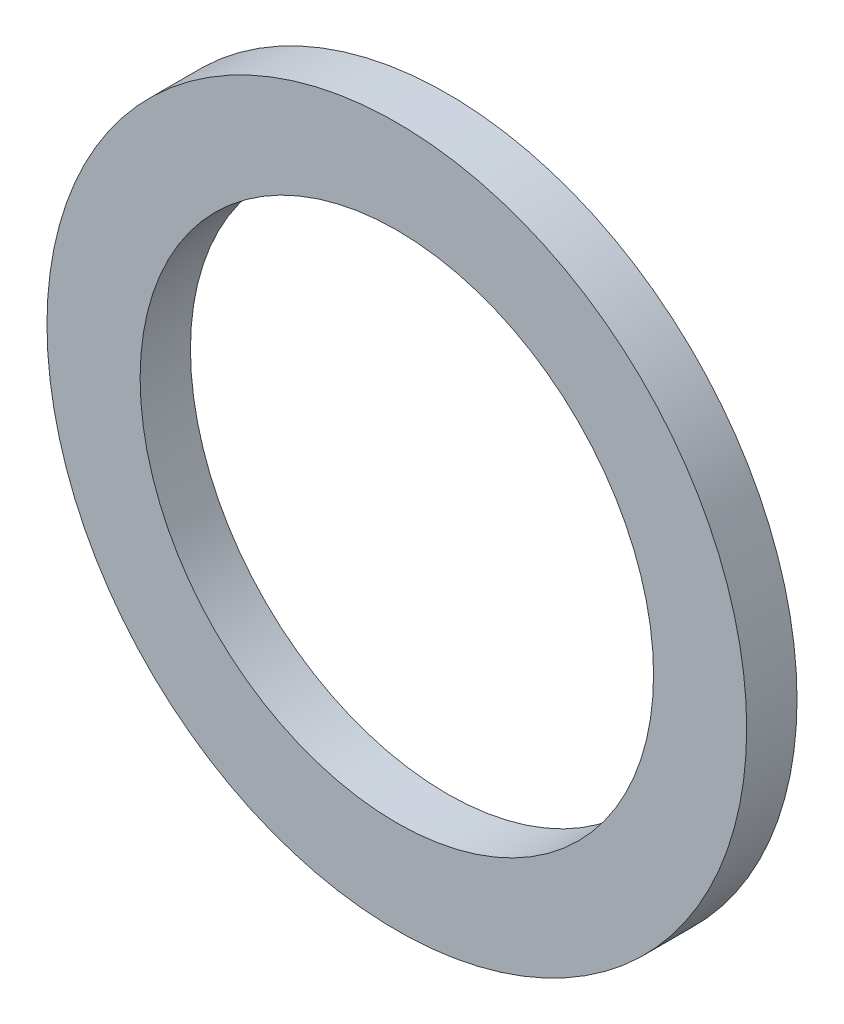
ISO-10303-21;
HEADER;
FILE_DESCRIPTION(('STEP AP214'),'2;1');
FILE_NAME('part.step','',(''),(''),'','','');
FILE_SCHEMA(('AUTOMOTIVE_DESIGN { 1 0 10303 214 1 1 1 1 }'));
ENDSEC;
DATA;
#1=APPLICATION_CONTEXT('core data for automotive mechanical design processes');
#2=APPLICATION_PROTOCOL_DEFINITION('international standard','automotive_design',2000,#1);
#3=PRODUCT_CONTEXT('',#1,'mechanical');
#4=PRODUCT('Part','Part','',(#3));
#5=PRODUCT_RELATED_PRODUCT_CATEGORY('part','',(#4));
#6=PRODUCT_DEFINITION_FORMATION('','',#4);
#7=PRODUCT_DEFINITION_CONTEXT('part definition',#1,'design');
#8=PRODUCT_DEFINITION('design','',#6,#7);
#9=PRODUCT_DEFINITION_SHAPE('','',#8);
#10=(LENGTH_UNIT() NAMED_UNIT(*) SI_UNIT(.MILLI.,.METRE.));
#11=(NAMED_UNIT(*) PLANE_ANGLE_UNIT() SI_UNIT($,.RADIAN.));
#12=(NAMED_UNIT(*) SI_UNIT($,.STERADIAN.) SOLID_ANGLE_UNIT());
#13=UNCERTAINTY_MEASURE_WITH_UNIT(LENGTH_MEASURE(1.E-05),#10,'distance_accuracy_value','');
#14=(GEOMETRIC_REPRESENTATION_CONTEXT(3) GLOBAL_UNCERTAINTY_ASSIGNED_CONTEXT((#13)) GLOBAL_UNIT_ASSIGNED_CONTEXT((#10,
#11,#12)) REPRESENTATION_CONTEXT('',''));
#15=CARTESIAN_POINT('',(0.,0.,0.));
#16=DIRECTION('',(0.,0.,1.));
#17=DIRECTION('',(1.,0.,0.));
#18=AXIS2_PLACEMENT_3D('',#15,#16,#17);
#19=CARTESIAN_POINT('',(0.,0.,0.5));
#20=DIRECTION('',(0.,0.,1.));
#21=DIRECTION('',(1.,0.,0.));
#22=AXIS2_PLACEMENT_3D('',#19,#20,#21);
#23=PLANE('',#22);
#24=CARTESIAN_POINT('',(0.,0.,0.5));
#25=DIRECTION('',(0.,0.,1.));
#26=DIRECTION('',(1.,0.,0.));
#27=AXIS2_PLACEMENT_3D('',#24,#25,#26);
#28=CIRCLE('',#27,6.95);
#29=CARTESIAN_POINT('',(6.95,0.,0.5));
#30=VERTEX_POINT('',#29);
#31=EDGE_CURVE('E10',#30,#30,#28,.T.);
#32=ORIENTED_EDGE('',*,*,#31,.T.);
#33=EDGE_LOOP('',(#32));
#34=FACE_BOUND('',#33,.T.);
#35=CARTESIAN_POINT('',(0.,0.,0.5));
#36=DIRECTION('',(0.,0.,1.));
#37=DIRECTION('',(1.,0.,0.));
#38=AXIS2_PLACEMENT_3D('',#35,#36,#37);
#39=CIRCLE('',#38,5.1);
#40=CARTESIAN_POINT('',(5.1,0.,0.5));
#41=VERTEX_POINT('',#40);
#42=EDGE_CURVE('E41',#41,#41,#39,.T.);
#43=ORIENTED_EDGE('',*,*,#42,.F.);
#44=EDGE_LOOP('',(#43));
#45=FACE_BOUND('',#44,.T.);
#46=ADVANCED_FACE('F30',(#34,#45),#23,.T.);
#47=CARTESIAN_POINT('',(0.,0.,-0.5));
#48=DIRECTION('',(0.,0.,1.));
#49=DIRECTION('',(1.,0.,0.));
#50=AXIS2_PLACEMENT_3D('',#47,#48,#49);
#51=PLANE('',#50);
#52=CARTESIAN_POINT('',(0.,0.,-0.5));
#53=DIRECTION('',(0.,0.,1.));
#54=DIRECTION('',(1.,0.,0.));
#55=AXIS2_PLACEMENT_3D('',#52,#53,#54);
#56=CIRCLE('',#55,6.95);
#57=CARTESIAN_POINT('',(6.95,0.,-0.5));
#58=VERTEX_POINT('',#57);
#59=EDGE_CURVE('E34',#58,#58,#56,.T.);
#60=ORIENTED_EDGE('',*,*,#59,.F.);
#61=EDGE_LOOP('',(#60));
#62=FACE_BOUND('',#61,.T.);
#63=CARTESIAN_POINT('',(0.,0.,-0.5));
#64=DIRECTION('',(0.,0.,1.));
#65=DIRECTION('',(1.,0.,0.));
#66=AXIS2_PLACEMENT_3D('',#63,#64,#65);
#67=CIRCLE('',#66,5.1);
#68=CARTESIAN_POINT('',(5.1,0.,-0.5));
#69=VERTEX_POINT('',#68);
#70=EDGE_CURVE('E43',#69,#69,#67,.T.);
#71=ORIENTED_EDGE('',*,*,#70,.T.);
#72=EDGE_LOOP('',(#71));
#73=FACE_BOUND('',#72,.T.);
#74=ADVANCED_FACE('F53',(#62,#73),#51,.F.);
#75=CARTESIAN_POINT('',(0.,0.,0.5));
#76=DIRECTION('',(0.,0.,-1.));
#77=DIRECTION('',(-1.,0.,0.));
#78=AXIS2_PLACEMENT_3D('',#75,#76,#77);
#79=CYLINDRICAL_SURFACE('',#78,6.95);
#80=ORIENTED_EDGE('',*,*,#31,.F.);
#81=EDGE_LOOP('',(#80));
#82=FACE_BOUND('',#81,.T.);
#83=ORIENTED_EDGE('',*,*,#59,.T.);
#84=EDGE_LOOP('',(#83));
#85=FACE_BOUND('',#84,.T.);
#86=ADVANCED_FACE('F32',(#82,#85),#79,.T.);
#87=CARTESIAN_POINT('',(0.,0.,0.5));
#88=DIRECTION('',(0.,0.,-1.));
#89=DIRECTION('',(-1.,0.,0.));
#90=AXIS2_PLACEMENT_3D('',#87,#88,#89);
#91=CYLINDRICAL_SURFACE('',#90,5.1);
#92=ORIENTED_EDGE('',*,*,#42,.T.);
#93=EDGE_LOOP('',(#92));
#94=FACE_BOUND('',#93,.T.);
#95=ORIENTED_EDGE('',*,*,#70,.F.);
#96=EDGE_LOOP('',(#95));
#97=FACE_BOUND('',#96,.T.);
#98=ADVANCED_FACE('F49',(#94,#97),#91,.F.);
#99=CLOSED_SHELL('',(#46,#74,#86,#98));
#100=MANIFOLD_SOLID_BREP('B2',#99);
#101=ADVANCED_BREP_SHAPE_REPRESENTATION('',(#18,#100),#14);
#102=SHAPE_DEFINITION_REPRESENTATION(#9,#101);
ENDSEC;
END-ISO-10303-21;
